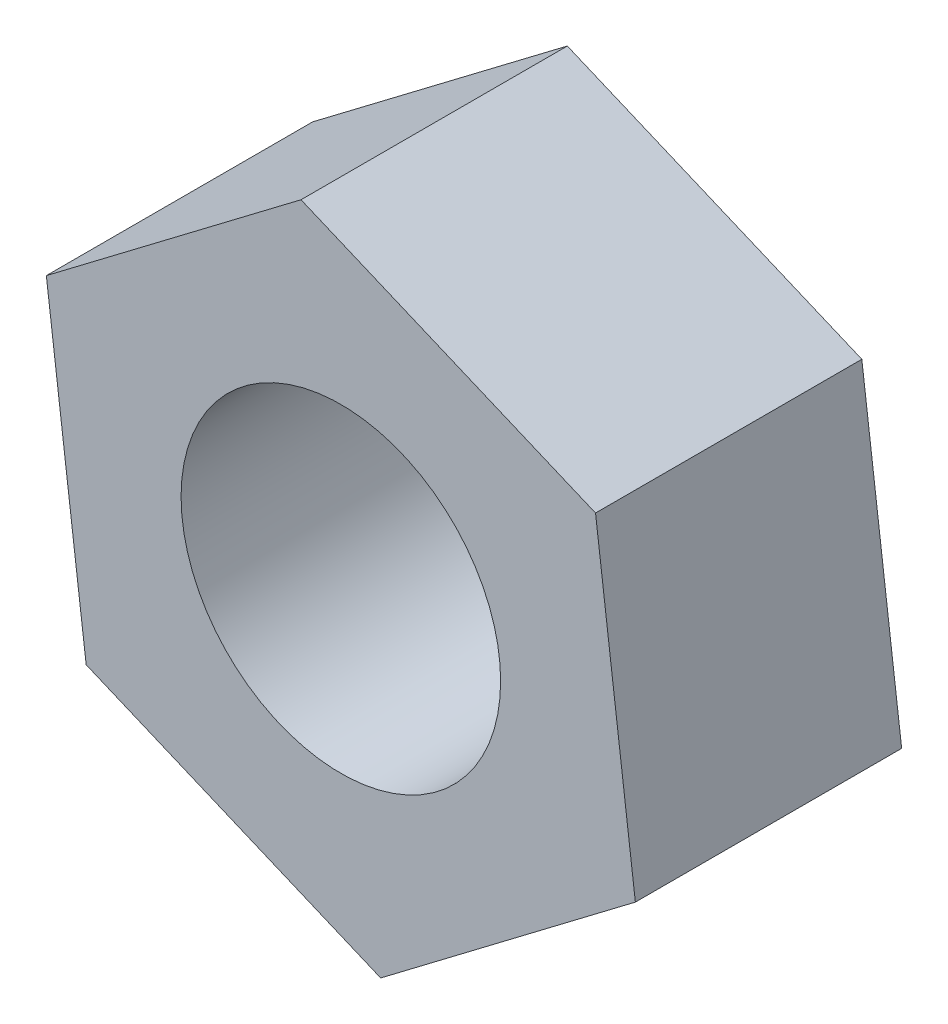
ISO-10303-21;
HEADER;
FILE_DESCRIPTION(('STEP AP214'),'2;1');
FILE_NAME('part.step','',(''),(''),'','','');
FILE_SCHEMA(('AUTOMOTIVE_DESIGN { 1 0 10303 214 1 1 1 1 }'));
ENDSEC;
DATA;
#1=APPLICATION_CONTEXT('core data for automotive mechanical design processes');
#2=APPLICATION_PROTOCOL_DEFINITION('international standard','automotive_design',2000,#1);
#3=PRODUCT_CONTEXT('',#1,'mechanical');
#4=PRODUCT('Part','Part','',(#3));
#5=PRODUCT_RELATED_PRODUCT_CATEGORY('part','',(#4));
#6=PRODUCT_DEFINITION_FORMATION('','',#4);
#7=PRODUCT_DEFINITION_CONTEXT('part definition',#1,'design');
#8=PRODUCT_DEFINITION('design','',#6,#7);
#9=PRODUCT_DEFINITION_SHAPE('','',#8);
#10=(LENGTH_UNIT() NAMED_UNIT(*) SI_UNIT(.MILLI.,.METRE.));
#11=(NAMED_UNIT(*) PLANE_ANGLE_UNIT() SI_UNIT($,.RADIAN.));
#12=(NAMED_UNIT(*) SI_UNIT($,.STERADIAN.) SOLID_ANGLE_UNIT());
#13=UNCERTAINTY_MEASURE_WITH_UNIT(LENGTH_MEASURE(1.E-05),#10,'distance_accuracy_value','');
#14=(GEOMETRIC_REPRESENTATION_CONTEXT(3) GLOBAL_UNCERTAINTY_ASSIGNED_CONTEXT((#13)) GLOBAL_UNIT_ASSIGNED_CONTEXT((#10,
#11,#12)) REPRESENTATION_CONTEXT('',''));
#15=CARTESIAN_POINT('',(0.,0.,0.));
#16=DIRECTION('',(0.,0.,1.));
#17=DIRECTION('',(1.,0.,0.));
#18=AXIS2_PLACEMENT_3D('',#15,#16,#17);
#19=CARTESIAN_POINT('',(0.,0.,5.));
#20=DIRECTION('',(0.,0.,1.));
#21=DIRECTION('',(1.,0.,0.));
#22=AXIS2_PLACEMENT_3D('',#19,#20,#21);
#23=PLANE('',#22);
#24=DIRECTION('',(-0.124653333367353,0.992200356017074,0.));
#25=VECTOR('',#24,1.);
#26=CARTESIAN_POINT('',(5.52958428383056,-2.32888334787599,5.));
#27=LINE('',#26,#25);
#28=CARTESIAN_POINT('',(5.52958428383056,-2.32888334787599,5.));
#29=VERTEX_POINT('',#28);
#30=CARTESIAN_POINT('',(4.78166428362644,3.62431878822645,5.));
#31=VERTEX_POINT('',#30);
#32=EDGE_CURVE('E146',#29,#31,#27,.T.);
#33=ORIENTED_EDGE('',*,*,#32,.T.);
#34=DIRECTION('',(-0.921597380638426,0.388147224645998,0.));
#35=VECTOR('',#34,1.);
#36=CARTESIAN_POINT('',(4.78166428362644,3.62431878822645,5.));
#37=LINE('',#36,#35);
#38=CARTESIAN_POINT('',(-0.747920000204119,5.95320213610244,5.));
#39=VERTEX_POINT('',#38);
#40=EDGE_CURVE('E94',#31,#39,#37,.T.);
#41=ORIENTED_EDGE('',*,*,#40,.T.);
#42=DIRECTION('',(-0.796944047271073,-0.604053131371076,0.));
#43=VECTOR('',#42,1.);
#44=CARTESIAN_POINT('',(-0.747920000204119,5.95320213610244,5.));
#45=LINE('',#44,#43);
#46=CARTESIAN_POINT('',(-5.52958428383056,2.32888334787599,5.));
#47=VERTEX_POINT('',#46);
#48=EDGE_CURVE('E107',#39,#47,#45,.T.);
#49=ORIENTED_EDGE('',*,*,#48,.T.);
#50=DIRECTION('',(0.124653333367354,-0.992200356017073,0.));
#51=VECTOR('',#50,1.);
#52=CARTESIAN_POINT('',(-5.52958428383056,2.32888334787599,5.));
#53=LINE('',#52,#51);
#54=CARTESIAN_POINT('',(-4.78166428362644,-3.62431878822645,5.));
#55=VERTEX_POINT('',#54);
#56=EDGE_CURVE('E101',#47,#55,#53,.T.);
#57=ORIENTED_EDGE('',*,*,#56,.T.);
#58=DIRECTION('',(0.921597380638427,-0.388147224645998,0.));
#59=VECTOR('',#58,1.);
#60=CARTESIAN_POINT('',(-4.78166428362644,-3.62431878822645,5.));
#61=LINE('',#60,#59);
#62=CARTESIAN_POINT('',(0.747920000204122,-5.95320213610244,5.));
#63=VERTEX_POINT('',#62);
#64=EDGE_CURVE('E105',#55,#63,#61,.T.);
#65=ORIENTED_EDGE('',*,*,#64,.T.);
#66=DIRECTION('',(0.796944047271073,0.604053131371075,0.));
#67=VECTOR('',#66,1.);
#68=CARTESIAN_POINT('',(0.747920000204122,-5.95320213610244,5.));
#69=LINE('',#68,#67);
#70=EDGE_CURVE('E57',#63,#29,#69,.T.);
#71=ORIENTED_EDGE('',*,*,#70,.T.);
#72=EDGE_LOOP('',(#33,#41,#49,#57,#65,#71));
#73=FACE_BOUND('',#72,.T.);
#74=CARTESIAN_POINT('',(0.,0.,5.));
#75=DIRECTION('',(0.,0.,1.));
#76=DIRECTION('',(1.,0.,0.));
#77=AXIS2_PLACEMENT_3D('',#74,#75,#76);
#78=CIRCLE('',#77,3.);
#79=CARTESIAN_POINT('',(3.,0.,5.));
#80=VERTEX_POINT('',#79);
#81=EDGE_CURVE('E134',#80,#80,#78,.T.);
#82=ORIENTED_EDGE('',*,*,#81,.F.);
#83=EDGE_LOOP('',(#82));
#84=FACE_BOUND('',#83,.T.);
#85=ADVANCED_FACE('F39',(#73,#84),#23,.T.);
#86=CARTESIAN_POINT('',(0.,0.,0.));
#87=DIRECTION('',(0.,0.,1.));
#88=DIRECTION('',(1.,0.,0.));
#89=AXIS2_PLACEMENT_3D('',#86,#87,#88);
#90=PLANE('',#89);
#91=DIRECTION('',(-0.124653333367353,0.992200356017074,0.));
#92=VECTOR('',#91,1.);
#93=CARTESIAN_POINT('',(5.52958428383056,-2.32888334787599,0.));
#94=LINE('',#93,#92);
#95=CARTESIAN_POINT('',(5.52958428383056,-2.32888334787599,0.));
#96=VERTEX_POINT('',#95);
#97=CARTESIAN_POINT('',(4.78166428362644,3.62431878822645,0.));
#98=VERTEX_POINT('',#97);
#99=EDGE_CURVE('E129',#96,#98,#94,.T.);
#100=ORIENTED_EDGE('',*,*,#99,.F.);
#101=DIRECTION('',(0.796944047271073,0.604053131371075,0.));
#102=VECTOR('',#101,1.);
#103=CARTESIAN_POINT('',(0.747920000204122,-5.95320213610244,0.));
#104=LINE('',#103,#102);
#105=CARTESIAN_POINT('',(0.747920000204122,-5.95320213610244,0.));
#106=VERTEX_POINT('',#105);
#107=EDGE_CURVE('E86',#106,#96,#104,.T.);
#108=ORIENTED_EDGE('',*,*,#107,.F.);
#109=DIRECTION('',(0.921597380638427,-0.388147224645998,0.));
#110=VECTOR('',#109,1.);
#111=CARTESIAN_POINT('',(-4.78166428362644,-3.62431878822645,0.));
#112=LINE('',#111,#110);
#113=CARTESIAN_POINT('',(-4.78166428362644,-3.62431878822645,0.));
#114=VERTEX_POINT('',#113);
#115=EDGE_CURVE('E80',#114,#106,#112,.T.);
#116=ORIENTED_EDGE('',*,*,#115,.F.);
#117=DIRECTION('',(0.124653333367354,-0.992200356017073,0.));
#118=VECTOR('',#117,1.);
#119=CARTESIAN_POINT('',(-5.52958428383056,2.32888334787599,0.));
#120=LINE('',#119,#118);
#121=CARTESIAN_POINT('',(-5.52958428383056,2.32888334787599,0.));
#122=VERTEX_POINT('',#121);
#123=EDGE_CURVE('E116',#122,#114,#120,.T.);
#124=ORIENTED_EDGE('',*,*,#123,.F.);
#125=DIRECTION('',(-0.796944047271073,-0.604053131371076,0.));
#126=VECTOR('',#125,1.);
#127=CARTESIAN_POINT('',(-0.747920000204119,5.95320213610244,0.));
#128=LINE('',#127,#126);
#129=CARTESIAN_POINT('',(-0.747920000204119,5.95320213610244,0.));
#130=VERTEX_POINT('',#129);
#131=EDGE_CURVE('E137',#130,#122,#128,.T.);
#132=ORIENTED_EDGE('',*,*,#131,.F.);
#133=DIRECTION('',(-0.921597380638426,0.388147224645998,0.));
#134=VECTOR('',#133,1.);
#135=CARTESIAN_POINT('',(4.78166428362644,3.62431878822645,0.));
#136=LINE('',#135,#134);
#137=EDGE_CURVE('E133',#98,#130,#136,.T.);
#138=ORIENTED_EDGE('',*,*,#137,.F.);
#139=EDGE_LOOP('',(#100,#108,#116,#124,#132,#138));
#140=FACE_BOUND('',#139,.T.);
#141=CARTESIAN_POINT('',(0.,0.,0.));
#142=DIRECTION('',(0.,0.,1.));
#143=DIRECTION('',(1.,0.,0.));
#144=AXIS2_PLACEMENT_3D('',#141,#142,#143);
#145=CIRCLE('',#144,3.);
#146=CARTESIAN_POINT('',(3.,0.,0.));
#147=VERTEX_POINT('',#146);
#148=EDGE_CURVE('E243',#147,#147,#145,.T.);
#149=ORIENTED_EDGE('',*,*,#148,.T.);
#150=EDGE_LOOP('',(#149));
#151=FACE_BOUND('',#150,.T.);
#152=ADVANCED_FACE('F159',(#140,#151),#90,.F.);
#153=CARTESIAN_POINT('',(5.52958428383056,-2.32888334787599,5.));
#154=DIRECTION('',(-0.992200356017074,-0.124653333367353,0.));
#155=DIRECTION('',(0.124653333367353,-0.992200356017074,0.));
#156=AXIS2_PLACEMENT_3D('',#153,#154,#155);
#157=PLANE('',#156);
#158=ORIENTED_EDGE('',*,*,#99,.T.);
#159=DIRECTION('',(0.,0.,-1.));
#160=VECTOR('',#159,1.);
#161=CARTESIAN_POINT('',(4.78166428362644,3.62431878822645,5.));
#162=LINE('',#161,#160);
#163=EDGE_CURVE('E11',#31,#98,#162,.T.);
#164=ORIENTED_EDGE('',*,*,#163,.F.);
#165=ORIENTED_EDGE('',*,*,#32,.F.);
#166=DIRECTION('',(0.,0.,-1.));
#167=VECTOR('',#166,1.);
#168=CARTESIAN_POINT('',(5.52958428383056,-2.32888334787599,5.));
#169=LINE('',#168,#167);
#170=EDGE_CURVE('E125',#29,#96,#169,.T.);
#171=ORIENTED_EDGE('',*,*,#170,.T.);
#172=EDGE_LOOP('',(#158,#164,#165,#171));
#173=FACE_BOUND('',#172,.T.);
#174=ADVANCED_FACE('F41',(#173),#157,.F.);
#175=CARTESIAN_POINT('',(4.78166428362644,3.62431878822645,5.));
#176=DIRECTION('',(-0.388147224645998,-0.921597380638427,0.));
#177=DIRECTION('',(0.921597380638427,-0.388147224645998,0.));
#178=AXIS2_PLACEMENT_3D('',#175,#176,#177);
#179=PLANE('',#178);
#180=ORIENTED_EDGE('',*,*,#137,.T.);
#181=DIRECTION('',(0.,0.,-1.));
#182=VECTOR('',#181,1.);
#183=CARTESIAN_POINT('',(-0.747920000204119,5.95320213610244,5.));
#184=LINE('',#183,#182);
#185=EDGE_CURVE('E49',#39,#130,#184,.T.);
#186=ORIENTED_EDGE('',*,*,#185,.F.);
#187=ORIENTED_EDGE('',*,*,#40,.F.);
#188=ORIENTED_EDGE('',*,*,#163,.T.);
#189=EDGE_LOOP('',(#180,#186,#187,#188));
#190=FACE_BOUND('',#189,.T.);
#191=ADVANCED_FACE('F184',(#190),#179,.F.);
#192=CARTESIAN_POINT('',(-0.747920000204119,5.95320213610244,5.));
#193=DIRECTION('',(0.604053131371076,-0.796944047271073,0.));
#194=DIRECTION('',(0.796944047271073,0.604053131371076,0.));
#195=AXIS2_PLACEMENT_3D('',#192,#193,#194);
#196=PLANE('',#195);
#197=ORIENTED_EDGE('',*,*,#131,.T.);
#198=DIRECTION('',(0.,0.,-1.));
#199=VECTOR('',#198,1.);
#200=CARTESIAN_POINT('',(-5.52958428383056,2.32888334787599,5.));
#201=LINE('',#200,#199);
#202=EDGE_CURVE('E118',#47,#122,#201,.T.);
#203=ORIENTED_EDGE('',*,*,#202,.F.);
#204=ORIENTED_EDGE('',*,*,#48,.F.);
#205=ORIENTED_EDGE('',*,*,#185,.T.);
#206=EDGE_LOOP('',(#197,#203,#204,#205));
#207=FACE_BOUND('',#206,.T.);
#208=ADVANCED_FACE('F156',(#207),#196,.F.);
#209=CARTESIAN_POINT('',(-5.52958428383056,2.32888334787599,5.));
#210=DIRECTION('',(0.992200356017073,0.124653333367354,0.));
#211=DIRECTION('',(-0.124653333367354,0.992200356017074,0.));
#212=AXIS2_PLACEMENT_3D('',#209,#210,#211);
#213=PLANE('',#212);
#214=ORIENTED_EDGE('',*,*,#123,.T.);
#215=DIRECTION('',(0.,0.,-1.));
#216=VECTOR('',#215,1.);
#217=CARTESIAN_POINT('',(-4.78166428362644,-3.62431878822645,5.));
#218=LINE('',#217,#216);
#219=EDGE_CURVE('E113',#55,#114,#218,.T.);
#220=ORIENTED_EDGE('',*,*,#219,.F.);
#221=ORIENTED_EDGE('',*,*,#56,.F.);
#222=ORIENTED_EDGE('',*,*,#202,.T.);
#223=EDGE_LOOP('',(#214,#220,#221,#222));
#224=FACE_BOUND('',#223,.T.);
#225=ADVANCED_FACE('F114',(#224),#213,.F.);
#226=CARTESIAN_POINT('',(-4.78166428362644,-3.62431878822645,5.));
#227=DIRECTION('',(0.388147224645998,0.921597380638427,0.));
#228=DIRECTION('',(-0.921597380638427,0.388147224645998,0.));
#229=AXIS2_PLACEMENT_3D('',#226,#227,#228);
#230=PLANE('',#229);
#231=ORIENTED_EDGE('',*,*,#115,.T.);
#232=DIRECTION('',(0.,0.,-1.));
#233=VECTOR('',#232,1.);
#234=CARTESIAN_POINT('',(0.747920000204122,-5.95320213610244,5.));
#235=LINE('',#234,#233);
#236=EDGE_CURVE('E119',#63,#106,#235,.T.);
#237=ORIENTED_EDGE('',*,*,#236,.F.);
#238=ORIENTED_EDGE('',*,*,#64,.F.);
#239=ORIENTED_EDGE('',*,*,#219,.T.);
#240=EDGE_LOOP('',(#231,#237,#238,#239));
#241=FACE_BOUND('',#240,.T.);
#242=ADVANCED_FACE('F121',(#241),#230,.F.);
#243=CARTESIAN_POINT('',(0.747920000204122,-5.95320213610244,5.));
#244=DIRECTION('',(-0.604053131371075,0.796944047271073,0.));
#245=DIRECTION('',(-0.796944047271073,-0.604053131371076,0.));
#246=AXIS2_PLACEMENT_3D('',#243,#244,#245);
#247=PLANE('',#246);
#248=ORIENTED_EDGE('',*,*,#107,.T.);
#249=ORIENTED_EDGE('',*,*,#170,.F.);
#250=ORIENTED_EDGE('',*,*,#70,.F.);
#251=ORIENTED_EDGE('',*,*,#236,.T.);
#252=EDGE_LOOP('',(#248,#249,#250,#251));
#253=FACE_BOUND('',#252,.T.);
#254=ADVANCED_FACE('F164',(#253),#247,.F.);
#255=CARTESIAN_POINT('',(0.,0.,5.));
#256=DIRECTION('',(0.,0.,-1.));
#257=DIRECTION('',(-1.,0.,0.));
#258=AXIS2_PLACEMENT_3D('',#255,#256,#257);
#259=CYLINDRICAL_SURFACE('',#258,3.);
#260=ORIENTED_EDGE('',*,*,#81,.T.);
#261=EDGE_LOOP('',(#260));
#262=FACE_BOUND('',#261,.T.);
#263=ORIENTED_EDGE('',*,*,#148,.F.);
#264=EDGE_LOOP('',(#263));
#265=FACE_BOUND('',#264,.T.);
#266=ADVANCED_FACE('F166',(#262,#265),#259,.F.);
#267=CLOSED_SHELL('',(#85,#152,#174,#191,#208,#225,#242,#254,#266));
#268=MANIFOLD_SOLID_BREP('B2',#267);
#269=ADVANCED_BREP_SHAPE_REPRESENTATION('',(#18,#268),#14);
#270=SHAPE_DEFINITION_REPRESENTATION(#9,#269);
ENDSEC;
END-ISO-10303-21;
